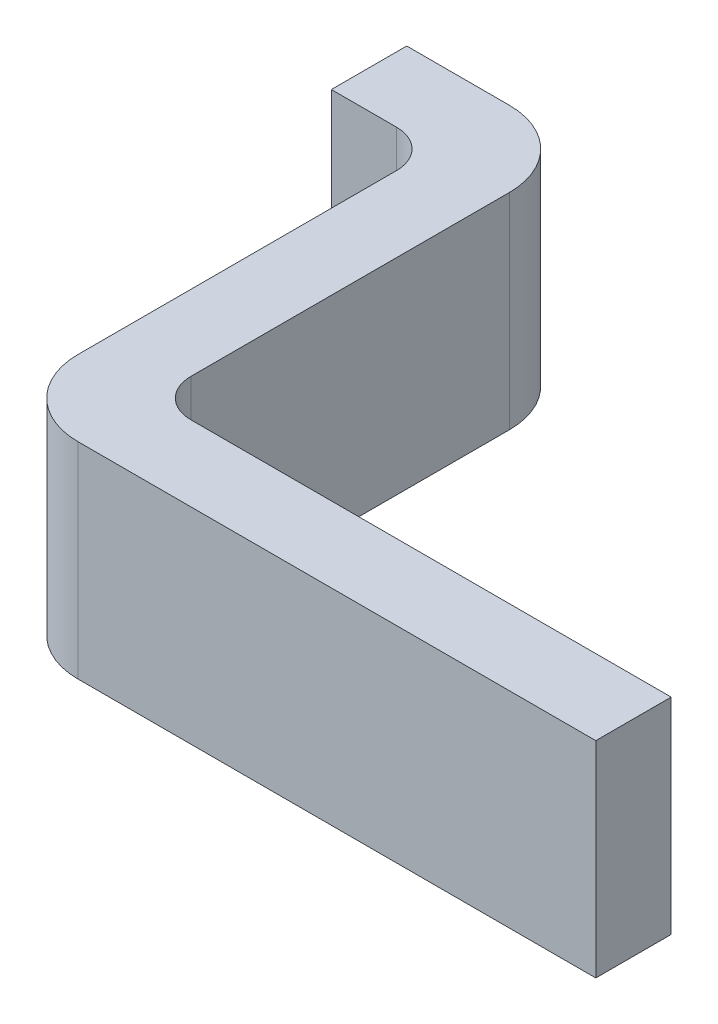
ISO-10303-21;
HEADER;
FILE_DESCRIPTION(('STEP AP214'),'2;1');
FILE_NAME('part.step','',(''),(''),'','','');
FILE_SCHEMA(('AUTOMOTIVE_DESIGN { 1 0 10303 214 1 1 1 1 }'));
ENDSEC;
DATA;
#1=APPLICATION_CONTEXT('core data for automotive mechanical design processes');
#2=APPLICATION_PROTOCOL_DEFINITION('international standard','automotive_design',2000,#1);
#3=PRODUCT_CONTEXT('',#1,'mechanical');
#4=PRODUCT('Part','Part','',(#3));
#5=PRODUCT_RELATED_PRODUCT_CATEGORY('part','',(#4));
#6=PRODUCT_DEFINITION_FORMATION('','',#4);
#7=PRODUCT_DEFINITION_CONTEXT('part definition',#1,'design');
#8=PRODUCT_DEFINITION('design','',#6,#7);
#9=PRODUCT_DEFINITION_SHAPE('','',#8);
#10=(LENGTH_UNIT() NAMED_UNIT(*) SI_UNIT(.MILLI.,.METRE.));
#11=(NAMED_UNIT(*) PLANE_ANGLE_UNIT() SI_UNIT($,.RADIAN.));
#12=(NAMED_UNIT(*) SI_UNIT($,.STERADIAN.) SOLID_ANGLE_UNIT());
#13=UNCERTAINTY_MEASURE_WITH_UNIT(LENGTH_MEASURE(1.E-05),#10,'distance_accuracy_value','');
#14=(GEOMETRIC_REPRESENTATION_CONTEXT(3) GLOBAL_UNCERTAINTY_ASSIGNED_CONTEXT((#13)) GLOBAL_UNIT_ASSIGNED_CONTEXT((#10,
#11,#12)) REPRESENTATION_CONTEXT('',''));
#15=CARTESIAN_POINT('',(0.,0.,0.));
#16=DIRECTION('',(0.,0.,1.));
#17=DIRECTION('',(1.,0.,0.));
#18=AXIS2_PLACEMENT_3D('',#15,#16,#17);
#19=CARTESIAN_POINT('',(-1.155,0.,0.165));
#20=DIRECTION('',(0.,1.,0.));
#21=DIRECTION('',(0.707106781186548,0.,-0.707106781186547));
#22=AXIS2_PLACEMENT_3D('',#19,#20,#21);
#23=CYLINDRICAL_SURFACE('',#22,0.055);
#24=CARTESIAN_POINT('',(-1.155,0.15,0.165));
#25=DIRECTION('',(0.,-1.,0.));
#26=DIRECTION('',(0.,0.,-1.));
#27=AXIS2_PLACEMENT_3D('',#24,#25,#26);
#28=CIRCLE('',#27,0.055);
#29=CARTESIAN_POINT('',(-1.155,0.15,0.11));
#30=VERTEX_POINT('',#29);
#31=CARTESIAN_POINT('',(-1.1,0.15,0.165));
#32=VERTEX_POINT('',#31);
#33=EDGE_CURVE('E11',#30,#32,#28,.T.);
#34=ORIENTED_EDGE('',*,*,#33,.F.);
#35=DIRECTION('',(0.,1.,0.));
#36=VECTOR('',#35,1.);
#37=CARTESIAN_POINT('',(-1.155,-0.15,0.11));
#38=LINE('',#37,#36);
#39=CARTESIAN_POINT('',(-1.155,-0.15,0.11));
#40=VERTEX_POINT('',#39);
#41=EDGE_CURVE('E202',#40,#30,#38,.T.);
#42=ORIENTED_EDGE('',*,*,#41,.F.);
#43=CARTESIAN_POINT('',(-1.155,-0.15,0.165));
#44=DIRECTION('',(0.,1.,0.));
#45=DIRECTION('',(1.,0.,0.));
#46=AXIS2_PLACEMENT_3D('',#43,#44,#45);
#47=CIRCLE('',#46,0.055);
#48=CARTESIAN_POINT('',(-1.1,-0.15,0.165));
#49=VERTEX_POINT('',#48);
#50=EDGE_CURVE('E127',#49,#40,#47,.T.);
#51=ORIENTED_EDGE('',*,*,#50,.F.);
#52=DIRECTION('',(0.,-1.,0.));
#53=VECTOR('',#52,1.);
#54=CARTESIAN_POINT('',(-1.1,0.15,0.165));
#55=LINE('',#54,#53);
#56=EDGE_CURVE('E24',#32,#49,#55,.T.);
#57=ORIENTED_EDGE('',*,*,#56,.F.);
#58=EDGE_LOOP('',(#34,#42,#51,#57));
#59=FACE_BOUND('',#58,.T.);
#60=ADVANCED_FACE('F17',(#59),#23,.F.);
#61=CARTESIAN_POINT('',(-1.1,0.,0.739926666323614));
#62=DIRECTION('',(1.,0.,0.));
#63=DIRECTION('',(0.,0.,-1.));
#64=AXIS2_PLACEMENT_3D('',#61,#62,#63);
#65=PLANE('',#64);
#66=ORIENTED_EDGE('',*,*,#56,.T.);
#67=DIRECTION('',(0.,0.,1.));
#68=VECTOR('',#67,1.);
#69=CARTESIAN_POINT('',(-1.1,-0.15,0.165));
#70=LINE('',#69,#68);
#71=CARTESIAN_POINT('',(-1.1,-0.15,0.629926666323614));
#72=VERTEX_POINT('',#71);
#73=EDGE_CURVE('E197',#49,#72,#70,.T.);
#74=ORIENTED_EDGE('',*,*,#73,.T.);
#75=DIRECTION('',(0.,1.,0.));
#76=VECTOR('',#75,1.);
#77=CARTESIAN_POINT('',(-1.1,-0.15,0.629926666323614));
#78=LINE('',#77,#76);
#79=CARTESIAN_POINT('',(-1.1,0.15,0.629926666323614));
#80=VERTEX_POINT('',#79);
#81=EDGE_CURVE('E189',#72,#80,#78,.T.);
#82=ORIENTED_EDGE('',*,*,#81,.T.);
#83=DIRECTION('',(0.,0.,-1.));
#84=VECTOR('',#83,1.);
#85=CARTESIAN_POINT('',(-1.1,0.15,0.629926666323614));
#86=LINE('',#85,#84);
#87=EDGE_CURVE('E179',#80,#32,#86,.T.);
#88=ORIENTED_EDGE('',*,*,#87,.T.);
#89=EDGE_LOOP('',(#66,#74,#82,#88));
#90=FACE_BOUND('',#89,.T.);
#91=ADVANCED_FACE('F233',(#90),#65,.F.);
#92=CARTESIAN_POINT('',(-0.935,0.,0.574926666323615));
#93=DIRECTION('',(0.,-1.,0.));
#94=DIRECTION('',(-0.707106781186548,0.,0.707106781186547));
#95=AXIS2_PLACEMENT_3D('',#92,#93,#94);
#96=CYLINDRICAL_SURFACE('',#95,0.055);
#97=CARTESIAN_POINT('',(-0.935,-0.15,0.574926666323615));
#98=DIRECTION('',(0.,1.,0.));
#99=DIRECTION('',(-1.,0.,0.));
#100=AXIS2_PLACEMENT_3D('',#97,#98,#99);
#101=CIRCLE('',#100,0.055);
#102=CARTESIAN_POINT('',(-0.99,-0.15,0.574926666323615));
#103=VERTEX_POINT('',#102);
#104=CARTESIAN_POINT('',(-0.935,-0.15,0.629926666323614));
#105=VERTEX_POINT('',#104);
#106=EDGE_CURVE('E199',#103,#105,#101,.T.);
#107=ORIENTED_EDGE('',*,*,#106,.F.);
#108=DIRECTION('',(0.,-1.,0.));
#109=VECTOR('',#108,1.);
#110=CARTESIAN_POINT('',(-0.99,0.15,0.574926666323615));
#111=LINE('',#110,#109);
#112=CARTESIAN_POINT('',(-0.99,0.15,0.574926666323615));
#113=VERTEX_POINT('',#112);
#114=EDGE_CURVE('E191',#113,#103,#111,.T.);
#115=ORIENTED_EDGE('',*,*,#114,.F.);
#116=CARTESIAN_POINT('',(-0.935,0.15,0.574926666323615));
#117=DIRECTION('',(0.,-1.,0.));
#118=DIRECTION('',(0.,0.,1.));
#119=AXIS2_PLACEMENT_3D('',#116,#117,#118);
#120=CIRCLE('',#119,0.055);
#121=CARTESIAN_POINT('',(-0.935,0.15,0.629926666323614));
#122=VERTEX_POINT('',#121);
#123=EDGE_CURVE('E181',#122,#113,#120,.T.);
#124=ORIENTED_EDGE('',*,*,#123,.F.);
#125=DIRECTION('',(0.,1.,0.));
#126=VECTOR('',#125,1.);
#127=CARTESIAN_POINT('',(-0.935,-0.15,0.629926666323614));
#128=LINE('',#127,#126);
#129=EDGE_CURVE('E194',#105,#122,#128,.T.);
#130=ORIENTED_EDGE('',*,*,#129,.F.);
#131=EDGE_LOOP('',(#107,#115,#124,#130));
#132=FACE_BOUND('',#131,.T.);
#133=ADVANCED_FACE('F215',(#132),#96,.F.);
#134=CARTESIAN_POINT('',(-1.1,0.,0.629926666323614));
#135=DIRECTION('',(0.,0.,1.));
#136=DIRECTION('',(1.,0.,0.));
#137=AXIS2_PLACEMENT_3D('',#134,#135,#136);
#138=PLANE('',#137);
#139=ORIENTED_EDGE('',*,*,#129,.T.);
#140=DIRECTION('',(1.,0.,0.));
#141=VECTOR('',#140,1.);
#142=CARTESIAN_POINT('',(-0.935,0.15,0.629926666323614));
#143=LINE('',#142,#141);
#144=CARTESIAN_POINT('',(-0.234180772746138,0.15,0.629926666323615));
#145=VERTEX_POINT('',#144);
#146=EDGE_CURVE('E184',#122,#145,#143,.T.);
#147=ORIENTED_EDGE('',*,*,#146,.T.);
#148=DIRECTION('',(0.,1.,0.));
#149=VECTOR('',#148,1.);
#150=CARTESIAN_POINT('',(-0.234180772746138,-0.15,0.629926666323615));
#151=LINE('',#150,#149);
#152=CARTESIAN_POINT('',(-0.234180772746138,-0.15,0.629926666323615));
#153=VERTEX_POINT('',#152);
#154=EDGE_CURVE('E173',#153,#145,#151,.T.);
#155=ORIENTED_EDGE('',*,*,#154,.F.);
#156=DIRECTION('',(-1.,0.,0.));
#157=VECTOR('',#156,1.);
#158=CARTESIAN_POINT('',(-0.234180772746138,-0.15,0.629926666323614));
#159=LINE('',#158,#157);
#160=EDGE_CURVE('E165',#153,#105,#159,.T.);
#161=ORIENTED_EDGE('',*,*,#160,.T.);
#162=EDGE_LOOP('',(#139,#147,#155,#161));
#163=FACE_BOUND('',#162,.T.);
#164=ADVANCED_FACE('F234',(#163),#138,.F.);
#165=CARTESIAN_POINT('',(-1.1,0.,0.11));
#166=DIRECTION('',(0.,-1.,0.));
#167=DIRECTION('',(0.707106781186548,0.,-0.707106781186547));
#168=AXIS2_PLACEMENT_3D('',#165,#166,#167);
#169=CYLINDRICAL_SURFACE('',#168,0.11);
#170=CARTESIAN_POINT('',(-1.1,0.15,0.11));
#171=DIRECTION('',(0.,1.,0.));
#172=DIRECTION('',(1.,0.,0.));
#173=AXIS2_PLACEMENT_3D('',#170,#171,#172);
#174=CIRCLE('',#173,0.11);
#175=CARTESIAN_POINT('',(-0.99,0.15,0.11));
#176=VERTEX_POINT('',#175);
#177=CARTESIAN_POINT('',(-1.1,0.15,0.));
#178=VERTEX_POINT('',#177);
#179=EDGE_CURVE('E186',#176,#178,#174,.T.);
#180=ORIENTED_EDGE('',*,*,#179,.F.);
#181=DIRECTION('',(0.,1.,0.));
#182=VECTOR('',#181,1.);
#183=CARTESIAN_POINT('',(-0.99,-0.15,0.11));
#184=LINE('',#183,#182);
#185=CARTESIAN_POINT('',(-0.99,-0.15,0.11));
#186=VERTEX_POINT('',#185);
#187=EDGE_CURVE('E176',#186,#176,#184,.T.);
#188=ORIENTED_EDGE('',*,*,#187,.F.);
#189=CARTESIAN_POINT('',(-1.1,-0.15,0.11));
#190=DIRECTION('',(0.,-1.,0.));
#191=DIRECTION('',(0.,0.,-1.));
#192=AXIS2_PLACEMENT_3D('',#189,#190,#191);
#193=CIRCLE('',#192,0.11);
#194=CARTESIAN_POINT('',(-1.1,-0.15,0.));
#195=VERTEX_POINT('',#194);
#196=EDGE_CURVE('E171',#195,#186,#193,.T.);
#197=ORIENTED_EDGE('',*,*,#196,.F.);
#198=DIRECTION('',(0.,-1.,0.));
#199=VECTOR('',#198,1.);
#200=CARTESIAN_POINT('',(-1.1,0.15,0.));
#201=LINE('',#200,#199);
#202=EDGE_CURVE('E159',#178,#195,#201,.T.);
#203=ORIENTED_EDGE('',*,*,#202,.F.);
#204=EDGE_LOOP('',(#180,#188,#197,#203));
#205=FACE_BOUND('',#204,.T.);
#206=ADVANCED_FACE('F236',(#205),#169,.T.);
#207=CARTESIAN_POINT('',(-0.99,0.,0.));
#208=DIRECTION('',(-1.,0.,0.));
#209=DIRECTION('',(0.,0.,1.));
#210=AXIS2_PLACEMENT_3D('',#207,#208,#209);
#211=PLANE('',#210);
#212=ORIENTED_EDGE('',*,*,#114,.T.);
#213=DIRECTION('',(0.,0.,-1.));
#214=VECTOR('',#213,1.);
#215=CARTESIAN_POINT('',(-0.99,-0.15,0.574926666323615));
#216=LINE('',#215,#214);
#217=EDGE_CURVE('E168',#103,#186,#216,.T.);
#218=ORIENTED_EDGE('',*,*,#217,.T.);
#219=ORIENTED_EDGE('',*,*,#187,.T.);
#220=DIRECTION('',(0.,0.,1.));
#221=VECTOR('',#220,1.);
#222=CARTESIAN_POINT('',(-0.99,0.15,0.11));
#223=LINE('',#222,#221);
#224=EDGE_CURVE('E154',#176,#113,#223,.T.);
#225=ORIENTED_EDGE('',*,*,#224,.T.);
#226=EDGE_LOOP('',(#212,#218,#219,#225));
#227=FACE_BOUND('',#226,.T.);
#228=ADVANCED_FACE('F212',(#227),#211,.F.);
#229=CARTESIAN_POINT('',(-0.667090386373069,-0.15,0.684926666323614));
#230=DIRECTION('',(0.,1.,0.));
#231=DIRECTION('',(0.,0.,-1.));
#232=AXIS2_PLACEMENT_3D('',#229,#230,#231);
#233=PLANE('',#232);
#234=ORIENTED_EDGE('',*,*,#196,.T.);
#235=ORIENTED_EDGE('',*,*,#217,.F.);
#236=ORIENTED_EDGE('',*,*,#106,.T.);
#237=ORIENTED_EDGE('',*,*,#160,.F.);
#238=DIRECTION('',(0.,0.,-1.));
#239=VECTOR('',#238,1.);
#240=CARTESIAN_POINT('',(-0.234180772746138,-0.15,0.739926666323615));
#241=LINE('',#240,#239);
#242=CARTESIAN_POINT('',(-0.234180772746138,-0.15,0.739926666323615));
#243=VERTEX_POINT('',#242);
#244=EDGE_CURVE('E141',#243,#153,#241,.T.);
#245=ORIENTED_EDGE('',*,*,#244,.F.);
#246=DIRECTION('',(1.,0.,0.));
#247=VECTOR('',#246,1.);
#248=CARTESIAN_POINT('',(-0.99,-0.15,0.739926666323614));
#249=LINE('',#248,#247);
#250=CARTESIAN_POINT('',(-0.99,-0.15,0.739926666323614));
#251=VERTEX_POINT('',#250);
#252=EDGE_CURVE('E152',#251,#243,#249,.T.);
#253=ORIENTED_EDGE('',*,*,#252,.F.);
#254=CARTESIAN_POINT('',(-0.99,-0.15,0.629926666323614));
#255=DIRECTION('',(0.,-1.,0.));
#256=DIRECTION('',(0.,0.,1.));
#257=AXIS2_PLACEMENT_3D('',#254,#255,#256);
#258=CIRCLE('',#257,0.11);
#259=EDGE_CURVE('E149',#251,#72,#258,.T.);
#260=ORIENTED_EDGE('',*,*,#259,.T.);
#261=ORIENTED_EDGE('',*,*,#73,.F.);
#262=ORIENTED_EDGE('',*,*,#50,.T.);
#263=DIRECTION('',(1.,0.,0.));
#264=VECTOR('',#263,1.);
#265=CARTESIAN_POINT('',(-1.25,-0.15,0.11));
#266=LINE('',#265,#264);
#267=CARTESIAN_POINT('',(-1.25,-0.15,0.11));
#268=VERTEX_POINT('',#267);
#269=EDGE_CURVE('E119',#268,#40,#266,.T.);
#270=ORIENTED_EDGE('',*,*,#269,.F.);
#271=DIRECTION('',(0.,0.,1.));
#272=VECTOR('',#271,1.);
#273=CARTESIAN_POINT('',(-1.25,-0.15,0.));
#274=LINE('',#273,#272);
#275=CARTESIAN_POINT('',(-1.25,-0.15,0.));
#276=VERTEX_POINT('',#275);
#277=EDGE_CURVE('E103',#276,#268,#274,.T.);
#278=ORIENTED_EDGE('',*,*,#277,.F.);
#279=DIRECTION('',(-1.,0.,0.));
#280=VECTOR('',#279,1.);
#281=CARTESIAN_POINT('',(-1.1,-0.15,0.));
#282=LINE('',#281,#280);
#283=EDGE_CURVE('E134',#195,#276,#282,.T.);
#284=ORIENTED_EDGE('',*,*,#283,.F.);
#285=EDGE_LOOP('',(#234,#235,#236,#237,#245,#253,#260,#261,#262,#270,#278,#284));
#286=FACE_BOUND('',#285,.T.);
#287=ADVANCED_FACE('F125',(#286),#233,.F.);
#288=CARTESIAN_POINT('',(-0.99,0.,0.629926666323614));
#289=DIRECTION('',(0.,-1.,0.));
#290=DIRECTION('',(-0.707106781186548,0.,0.707106781186548));
#291=AXIS2_PLACEMENT_3D('',#288,#289,#290);
#292=CYLINDRICAL_SURFACE('',#291,0.11);
#293=CARTESIAN_POINT('',(-0.99,0.15,0.629926666323614));
#294=DIRECTION('',(0.,1.,0.));
#295=DIRECTION('',(-1.,0.,0.));
#296=AXIS2_PLACEMENT_3D('',#293,#294,#295);
#297=CIRCLE('',#296,0.11);
#298=CARTESIAN_POINT('',(-0.99,0.15,0.739926666323614));
#299=VERTEX_POINT('',#298);
#300=EDGE_CURVE('E162',#80,#299,#297,.T.);
#301=ORIENTED_EDGE('',*,*,#300,.F.);
#302=ORIENTED_EDGE('',*,*,#81,.F.);
#303=ORIENTED_EDGE('',*,*,#259,.F.);
#304=DIRECTION('',(0.,-1.,0.));
#305=VECTOR('',#304,1.);
#306=CARTESIAN_POINT('',(-0.99,0.15,0.739926666323614));
#307=LINE('',#306,#305);
#308=EDGE_CURVE('E157',#299,#251,#307,.T.);
#309=ORIENTED_EDGE('',*,*,#308,.F.);
#310=EDGE_LOOP('',(#301,#302,#303,#309));
#311=FACE_BOUND('',#310,.T.);
#312=ADVANCED_FACE('F232',(#311),#292,.T.);
#313=CARTESIAN_POINT('',(-0.99,0.,0.739926666323614));
#314=DIRECTION('',(0.,0.,-1.));
#315=DIRECTION('',(-1.,0.,0.));
#316=AXIS2_PLACEMENT_3D('',#313,#314,#315);
#317=PLANE('',#316);
#318=ORIENTED_EDGE('',*,*,#308,.T.);
#319=ORIENTED_EDGE('',*,*,#252,.T.);
#320=DIRECTION('',(0.,1.,0.));
#321=VECTOR('',#320,1.);
#322=CARTESIAN_POINT('',(-0.234180772746138,-0.15,0.739926666323615));
#323=LINE('',#322,#321);
#324=CARTESIAN_POINT('',(-0.234180772746138,0.15,0.739926666323615));
#325=VERTEX_POINT('',#324);
#326=EDGE_CURVE('E147',#243,#325,#323,.T.);
#327=ORIENTED_EDGE('',*,*,#326,.T.);
#328=DIRECTION('',(-1.,0.,0.));
#329=VECTOR('',#328,1.);
#330=CARTESIAN_POINT('',(-0.234180772746138,0.15,0.739926666323615));
#331=LINE('',#330,#329);
#332=EDGE_CURVE('E136',#325,#299,#331,.T.);
#333=ORIENTED_EDGE('',*,*,#332,.T.);
#334=EDGE_LOOP('',(#318,#319,#327,#333));
#335=FACE_BOUND('',#334,.T.);
#336=ADVANCED_FACE('F227',(#335),#317,.F.);
#337=CARTESIAN_POINT('',(-0.667090386373069,0.15,0.684926666323614));
#338=DIRECTION('',(0.,-1.,0.));
#339=DIRECTION('',(0.,0.,1.));
#340=AXIS2_PLACEMENT_3D('',#337,#338,#339);
#341=PLANE('',#340);
#342=ORIENTED_EDGE('',*,*,#179,.T.);
#343=DIRECTION('',(1.,0.,0.));
#344=VECTOR('',#343,1.);
#345=CARTESIAN_POINT('',(-1.25,0.15,0.));
#346=LINE('',#345,#344);
#347=CARTESIAN_POINT('',(-1.25,0.15,0.));
#348=VERTEX_POINT('',#347);
#349=EDGE_CURVE('E144',#348,#178,#346,.T.);
#350=ORIENTED_EDGE('',*,*,#349,.F.);
#351=DIRECTION('',(0.,0.,-1.));
#352=VECTOR('',#351,1.);
#353=CARTESIAN_POINT('',(-1.25,0.15,0.11));
#354=LINE('',#353,#352);
#355=CARTESIAN_POINT('',(-1.25,0.15,0.11));
#356=VERTEX_POINT('',#355);
#357=EDGE_CURVE('E139',#356,#348,#354,.T.);
#358=ORIENTED_EDGE('',*,*,#357,.F.);
#359=DIRECTION('',(-1.,0.,0.));
#360=VECTOR('',#359,1.);
#361=CARTESIAN_POINT('',(-1.155,0.15,0.11));
#362=LINE('',#361,#360);
#363=EDGE_CURVE('E121',#30,#356,#362,.T.);
#364=ORIENTED_EDGE('',*,*,#363,.F.);
#365=ORIENTED_EDGE('',*,*,#33,.T.);
#366=ORIENTED_EDGE('',*,*,#87,.F.);
#367=ORIENTED_EDGE('',*,*,#300,.T.);
#368=ORIENTED_EDGE('',*,*,#332,.F.);
#369=DIRECTION('',(0.,0.,1.));
#370=VECTOR('',#369,1.);
#371=CARTESIAN_POINT('',(-0.234180772746138,0.15,0.629926666323615));
#372=LINE('',#371,#370);
#373=EDGE_CURVE('E113',#145,#325,#372,.T.);
#374=ORIENTED_EDGE('',*,*,#373,.F.);
#375=ORIENTED_EDGE('',*,*,#146,.F.);
#376=ORIENTED_EDGE('',*,*,#123,.T.);
#377=ORIENTED_EDGE('',*,*,#224,.F.);
#378=EDGE_LOOP('',(#342,#350,#358,#364,#365,#366,#367,#368,#374,#375,#376,#377));
#379=FACE_BOUND('',#378,.T.);
#380=ADVANCED_FACE('F204',(#379),#341,.F.);
#381=CARTESIAN_POINT('',(-0.234180772746138,0.,0.629926666323615));
#382=DIRECTION('',(-1.,0.,0.));
#383=DIRECTION('',(0.,0.,1.));
#384=AXIS2_PLACEMENT_3D('',#381,#382,#383);
#385=PLANE('',#384);
#386=ORIENTED_EDGE('',*,*,#326,.F.);
#387=ORIENTED_EDGE('',*,*,#244,.T.);
#388=ORIENTED_EDGE('',*,*,#154,.T.);
#389=ORIENTED_EDGE('',*,*,#373,.T.);
#390=EDGE_LOOP('',(#386,#387,#388,#389));
#391=FACE_BOUND('',#390,.T.);
#392=ADVANCED_FACE('F223',(#391),#385,.F.);
#393=CARTESIAN_POINT('',(-1.25,0.,0.));
#394=DIRECTION('',(0.,0.,1.));
#395=DIRECTION('',(1.,0.,0.));
#396=AXIS2_PLACEMENT_3D('',#393,#394,#395);
#397=PLANE('',#396);
#398=ORIENTED_EDGE('',*,*,#202,.T.);
#399=ORIENTED_EDGE('',*,*,#283,.T.);
#400=DIRECTION('',(0.,-1.,0.));
#401=VECTOR('',#400,1.);
#402=CARTESIAN_POINT('',(-1.25,0.15,0.));
#403=LINE('',#402,#401);
#404=EDGE_CURVE('E109',#348,#276,#403,.T.);
#405=ORIENTED_EDGE('',*,*,#404,.F.);
#406=ORIENTED_EDGE('',*,*,#349,.T.);
#407=EDGE_LOOP('',(#398,#399,#405,#406));
#408=FACE_BOUND('',#407,.T.);
#409=ADVANCED_FACE('F208',(#408),#397,.F.);
#410=CARTESIAN_POINT('',(-0.99,0.,0.11));
#411=DIRECTION('',(0.,0.,-1.));
#412=DIRECTION('',(-1.,0.,0.));
#413=AXIS2_PLACEMENT_3D('',#410,#411,#412);
#414=PLANE('',#413);
#415=ORIENTED_EDGE('',*,*,#41,.T.);
#416=ORIENTED_EDGE('',*,*,#363,.T.);
#417=DIRECTION('',(0.,1.,0.));
#418=VECTOR('',#417,1.);
#419=CARTESIAN_POINT('',(-1.25,-0.15,0.11));
#420=LINE('',#419,#418);
#421=EDGE_CURVE('E107',#268,#356,#420,.T.);
#422=ORIENTED_EDGE('',*,*,#421,.F.);
#423=ORIENTED_EDGE('',*,*,#269,.T.);
#424=EDGE_LOOP('',(#415,#416,#422,#423));
#425=FACE_BOUND('',#424,.T.);
#426=ADVANCED_FACE('F118',(#425),#414,.F.);
#427=CARTESIAN_POINT('',(-1.25,0.,0.11));
#428=DIRECTION('',(1.,0.,0.));
#429=DIRECTION('',(0.,0.,-1.));
#430=AXIS2_PLACEMENT_3D('',#427,#428,#429);
#431=PLANE('',#430);
#432=ORIENTED_EDGE('',*,*,#404,.T.);
#433=ORIENTED_EDGE('',*,*,#277,.T.);
#434=ORIENTED_EDGE('',*,*,#421,.T.);
#435=ORIENTED_EDGE('',*,*,#357,.T.);
#436=EDGE_LOOP('',(#432,#433,#434,#435));
#437=FACE_BOUND('',#436,.T.);
#438=ADVANCED_FACE('F105',(#437),#431,.F.);
#439=CLOSED_SHELL('',(#60,#91,#133,#164,#206,#228,#287,#312,#336,#380,#392,#409,#426,#438));
#440=MANIFOLD_SOLID_BREP('B1',#439);
#441=ADVANCED_BREP_SHAPE_REPRESENTATION('',(#18,#440),#14);
#442=SHAPE_DEFINITION_REPRESENTATION(#9,#441);
ENDSEC;
END-ISO-10303-21;
